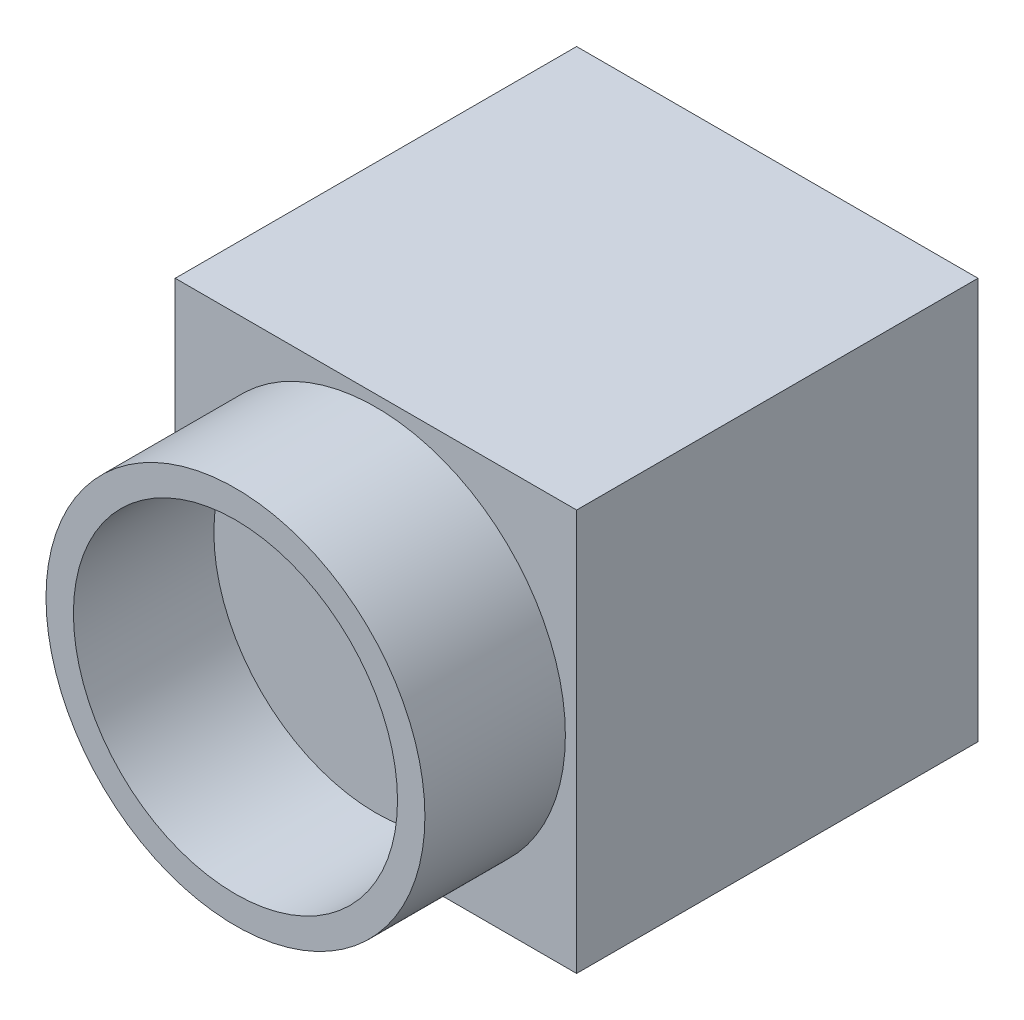
ISO-10303-21;
HEADER;
FILE_DESCRIPTION(('STEP AP214'),'2;1');
FILE_NAME('part.step','',(''),(''),'','','');
FILE_SCHEMA(('AUTOMOTIVE_DESIGN { 1 0 10303 214 1 1 1 1 }'));
ENDSEC;
DATA;
#1=APPLICATION_CONTEXT('core data for automotive mechanical design processes');
#2=APPLICATION_PROTOCOL_DEFINITION('international standard','automotive_design',2000,#1);
#3=PRODUCT_CONTEXT('',#1,'mechanical');
#4=PRODUCT('Part','Part','',(#3));
#5=PRODUCT_RELATED_PRODUCT_CATEGORY('part','',(#4));
#6=PRODUCT_DEFINITION_FORMATION('','',#4);
#7=PRODUCT_DEFINITION_CONTEXT('part definition',#1,'design');
#8=PRODUCT_DEFINITION('design','',#6,#7);
#9=PRODUCT_DEFINITION_SHAPE('','',#8);
#10=(LENGTH_UNIT() NAMED_UNIT(*) SI_UNIT(.MILLI.,.METRE.));
#11=(NAMED_UNIT(*) PLANE_ANGLE_UNIT() SI_UNIT($,.RADIAN.));
#12=(NAMED_UNIT(*) SI_UNIT($,.STERADIAN.) SOLID_ANGLE_UNIT());
#13=UNCERTAINTY_MEASURE_WITH_UNIT(LENGTH_MEASURE(1.E-05),#10,'distance_accuracy_value','');
#14=(GEOMETRIC_REPRESENTATION_CONTEXT(3) GLOBAL_UNCERTAINTY_ASSIGNED_CONTEXT((#13)) GLOBAL_UNIT_ASSIGNED_CONTEXT((#10,
#11,#12)) REPRESENTATION_CONTEXT('',''));
#15=CARTESIAN_POINT('',(0.,0.,0.));
#16=DIRECTION('',(0.,0.,1.));
#17=DIRECTION('',(1.,0.,0.));
#18=AXIS2_PLACEMENT_3D('',#15,#16,#17);
#19=CARTESIAN_POINT('',(14.645,14.645,-14.645));
#20=DIRECTION('',(-1.,0.,0.));
#21=DIRECTION('',(0.,0.,1.));
#22=AXIS2_PLACEMENT_3D('',#19,#20,#21);
#23=PLANE('',#22);
#24=DIRECTION('',(0.,0.,-1.));
#25=VECTOR('',#24,1.);
#26=CARTESIAN_POINT('',(14.645,-14.645,-14.645));
#27=LINE('',#26,#25);
#28=CARTESIAN_POINT('',(14.645,-14.645,14.645));
#29=VERTEX_POINT('',#28);
#30=CARTESIAN_POINT('',(14.645,-14.645,-14.645));
#31=VERTEX_POINT('',#30);
#32=EDGE_CURVE('E109',#29,#31,#27,.T.);
#33=ORIENTED_EDGE('',*,*,#32,.T.);
#34=DIRECTION('',(0.,-1.,0.));
#35=VECTOR('',#34,1.);
#36=CARTESIAN_POINT('',(14.645,14.645,-14.645));
#37=LINE('',#36,#35);
#38=CARTESIAN_POINT('',(14.645,14.645,-14.645));
#39=VERTEX_POINT('',#38);
#40=EDGE_CURVE('E46',#39,#31,#37,.T.);
#41=ORIENTED_EDGE('',*,*,#40,.F.);
#42=DIRECTION('',(0.,0.,-1.));
#43=VECTOR('',#42,1.);
#44=CARTESIAN_POINT('',(14.645,14.645,-14.645));
#45=LINE('',#44,#43);
#46=CARTESIAN_POINT('',(14.645,14.645,14.645));
#47=VERTEX_POINT('',#46);
#48=EDGE_CURVE('E96',#47,#39,#45,.T.);
#49=ORIENTED_EDGE('',*,*,#48,.F.);
#50=DIRECTION('',(0.,-1.,0.));
#51=VECTOR('',#50,1.);
#52=CARTESIAN_POINT('',(14.645,14.645,14.645));
#53=LINE('',#52,#51);
#54=EDGE_CURVE('E105',#47,#29,#53,.T.);
#55=ORIENTED_EDGE('',*,*,#54,.T.);
#56=EDGE_LOOP('',(#33,#41,#49,#55));
#57=FACE_BOUND('',#56,.T.);
#58=ADVANCED_FACE('F43',(#57),#23,.F.);
#59=CARTESIAN_POINT('',(-14.645,14.645,-14.645));
#60=DIRECTION('',(0.,0.,1.));
#61=DIRECTION('',(1.,0.,0.));
#62=AXIS2_PLACEMENT_3D('',#59,#60,#61);
#63=PLANE('',#62);
#64=DIRECTION('',(-1.,0.,0.));
#65=VECTOR('',#64,1.);
#66=CARTESIAN_POINT('',(-14.645,-14.645,-14.645));
#67=LINE('',#66,#65);
#68=CARTESIAN_POINT('',(-14.645,-14.645,-14.645));
#69=VERTEX_POINT('',#68);
#70=EDGE_CURVE('E101',#31,#69,#67,.T.);
#71=ORIENTED_EDGE('',*,*,#70,.T.);
#72=DIRECTION('',(0.,-1.,0.));
#73=VECTOR('',#72,1.);
#74=CARTESIAN_POINT('',(-14.645,14.645,-14.645));
#75=LINE('',#74,#73);
#76=CARTESIAN_POINT('',(-14.645,14.645,-14.645));
#77=VERTEX_POINT('',#76);
#78=EDGE_CURVE('E99',#77,#69,#75,.T.);
#79=ORIENTED_EDGE('',*,*,#78,.F.);
#80=DIRECTION('',(-1.,0.,0.));
#81=VECTOR('',#80,1.);
#82=CARTESIAN_POINT('',(-14.645,14.645,-14.645));
#83=LINE('',#82,#81);
#84=EDGE_CURVE('E91',#39,#77,#83,.T.);
#85=ORIENTED_EDGE('',*,*,#84,.F.);
#86=ORIENTED_EDGE('',*,*,#40,.T.);
#87=EDGE_LOOP('',(#71,#79,#85,#86));
#88=FACE_BOUND('',#87,.T.);
#89=ADVANCED_FACE('F100',(#88),#63,.F.);
#90=CARTESIAN_POINT('',(-14.645,14.645,-14.645));
#91=DIRECTION('',(1.,0.,0.));
#92=DIRECTION('',(0.,0.,-1.));
#93=AXIS2_PLACEMENT_3D('',#90,#91,#92);
#94=PLANE('',#93);
#95=DIRECTION('',(0.,0.,1.));
#96=VECTOR('',#95,1.);
#97=CARTESIAN_POINT('',(-14.645,-14.645,-14.645));
#98=LINE('',#97,#96);
#99=CARTESIAN_POINT('',(-14.645,-14.645,14.645));
#100=VERTEX_POINT('',#99);
#101=EDGE_CURVE('E77',#69,#100,#98,.T.);
#102=ORIENTED_EDGE('',*,*,#101,.T.);
#103=DIRECTION('',(0.,-1.,0.));
#104=VECTOR('',#103,1.);
#105=CARTESIAN_POINT('',(-14.645,14.645,14.645));
#106=LINE('',#105,#104);
#107=CARTESIAN_POINT('',(-14.645,14.645,14.645));
#108=VERTEX_POINT('',#107);
#109=EDGE_CURVE('E102',#108,#100,#106,.T.);
#110=ORIENTED_EDGE('',*,*,#109,.F.);
#111=DIRECTION('',(0.,0.,1.));
#112=VECTOR('',#111,1.);
#113=CARTESIAN_POINT('',(-14.645,14.645,-14.645));
#114=LINE('',#113,#112);
#115=EDGE_CURVE('E94',#77,#108,#114,.T.);
#116=ORIENTED_EDGE('',*,*,#115,.F.);
#117=ORIENTED_EDGE('',*,*,#78,.T.);
#118=EDGE_LOOP('',(#102,#110,#116,#117));
#119=FACE_BOUND('',#118,.T.);
#120=ADVANCED_FACE('F103',(#119),#94,.F.);
#121=CARTESIAN_POINT('',(-14.645,14.645,14.645));
#122=DIRECTION('',(0.,0.,-1.));
#123=DIRECTION('',(-1.,0.,0.));
#124=AXIS2_PLACEMENT_3D('',#121,#122,#123);
#125=PLANE('',#124);
#126=CARTESIAN_POINT('',(0.,0.,14.645));
#127=DIRECTION('',(0.,0.,1.));
#128=DIRECTION('',(1.,0.,0.));
#129=AXIS2_PLACEMENT_3D('',#126,#127,#128);
#130=CIRCLE('',#129,13.825);
#131=CARTESIAN_POINT('',(13.825,0.,14.645));
#132=VERTEX_POINT('',#131);
#133=EDGE_CURVE('E11',#132,#132,#130,.T.);
#134=ORIENTED_EDGE('',*,*,#133,.F.);
#135=EDGE_LOOP('',(#134));
#136=FACE_BOUND('',#135,.T.);
#137=DIRECTION('',(1.,0.,0.));
#138=VECTOR('',#137,1.);
#139=CARTESIAN_POINT('',(-14.645,-14.645,14.645));
#140=LINE('',#139,#138);
#141=EDGE_CURVE('E83',#100,#29,#140,.T.);
#142=ORIENTED_EDGE('',*,*,#141,.T.);
#143=ORIENTED_EDGE('',*,*,#54,.F.);
#144=DIRECTION('',(1.,0.,0.));
#145=VECTOR('',#144,1.);
#146=CARTESIAN_POINT('',(-14.645,14.645,14.645));
#147=LINE('',#146,#145);
#148=EDGE_CURVE('E60',#108,#47,#147,.T.);
#149=ORIENTED_EDGE('',*,*,#148,.F.);
#150=ORIENTED_EDGE('',*,*,#109,.T.);
#151=EDGE_LOOP('',(#142,#143,#149,#150));
#152=FACE_BOUND('',#151,.T.);
#153=ADVANCED_FACE('F117',(#136,#152),#125,.F.);
#154=CARTESIAN_POINT('',(0.,14.645,0.));
#155=DIRECTION('',(0.,1.,0.));
#156=DIRECTION('',(0.,0.,1.));
#157=AXIS2_PLACEMENT_3D('',#154,#155,#156);
#158=PLANE('',#157);
#159=ORIENTED_EDGE('',*,*,#48,.T.);
#160=ORIENTED_EDGE('',*,*,#84,.T.);
#161=ORIENTED_EDGE('',*,*,#115,.T.);
#162=ORIENTED_EDGE('',*,*,#148,.T.);
#163=EDGE_LOOP('',(#159,#160,#161,#162));
#164=FACE_BOUND('',#163,.T.);
#165=ADVANCED_FACE('F92',(#164),#158,.T.);
#166=CARTESIAN_POINT('',(0.,-14.645,0.));
#167=DIRECTION('',(0.,1.,0.));
#168=DIRECTION('',(0.,0.,1.));
#169=AXIS2_PLACEMENT_3D('',#166,#167,#168);
#170=PLANE('',#169);
#171=ORIENTED_EDGE('',*,*,#32,.F.);
#172=ORIENTED_EDGE('',*,*,#141,.F.);
#173=ORIENTED_EDGE('',*,*,#101,.F.);
#174=ORIENTED_EDGE('',*,*,#70,.F.);
#175=EDGE_LOOP('',(#171,#172,#173,#174));
#176=FACE_BOUND('',#175,.T.);
#177=ADVANCED_FACE('F120',(#176),#170,.F.);
#178=CARTESIAN_POINT('',(0.,0.,24.895));
#179=DIRECTION('',(0.,0.,-1.));
#180=DIRECTION('',(-1.,0.,0.));
#181=AXIS2_PLACEMENT_3D('',#178,#179,#180);
#182=CYLINDRICAL_SURFACE('',#181,13.825);
#183=CARTESIAN_POINT('',(0.,0.,24.895));
#184=DIRECTION('',(0.,0.,1.));
#185=DIRECTION('',(1.,0.,0.));
#186=AXIS2_PLACEMENT_3D('',#183,#184,#185);
#187=CIRCLE('',#186,13.825);
#188=CARTESIAN_POINT('',(13.825,0.,24.895));
#189=VERTEX_POINT('',#188);
#190=EDGE_CURVE('E112',#189,#189,#187,.T.);
#191=ORIENTED_EDGE('',*,*,#190,.F.);
#192=EDGE_LOOP('',(#191));
#193=FACE_BOUND('',#192,.T.);
#194=ORIENTED_EDGE('',*,*,#133,.T.);
#195=EDGE_LOOP('',(#194));
#196=FACE_BOUND('',#195,.T.);
#197=ADVANCED_FACE('F139',(#193,#196),#182,.T.);
#198=CARTESIAN_POINT('',(0.,0.,24.895));
#199=DIRECTION('',(0.,0.,1.));
#200=DIRECTION('',(1.,0.,0.));
#201=AXIS2_PLACEMENT_3D('',#198,#199,#200);
#202=PLANE('',#201);
#203=CARTESIAN_POINT('',(0.,0.,24.895));
#204=DIRECTION('',(0.,0.,1.));
#205=DIRECTION('',(1.,0.,0.));
#206=AXIS2_PLACEMENT_3D('',#203,#204,#205);
#207=CIRCLE('',#206,11.825);
#208=CARTESIAN_POINT('',(11.825,0.,24.895));
#209=VERTEX_POINT('',#208);
#210=EDGE_CURVE('E128',#209,#209,#207,.T.);
#211=ORIENTED_EDGE('',*,*,#210,.F.);
#212=EDGE_LOOP('',(#211));
#213=FACE_BOUND('',#212,.T.);
#214=ORIENTED_EDGE('',*,*,#190,.T.);
#215=EDGE_LOOP('',(#214));
#216=FACE_BOUND('',#215,.T.);
#217=ADVANCED_FACE('F135',(#213,#216),#202,.T.);
#218=CARTESIAN_POINT('',(-14.645,14.645,14.645));
#219=DIRECTION('',(0.,0.,-1.));
#220=DIRECTION('',(-1.,0.,0.));
#221=AXIS2_PLACEMENT_3D('',#218,#219,#220);
#222=PLANE('',#221);
#223=CARTESIAN_POINT('',(0.,0.,14.645));
#224=DIRECTION('',(0.,0.,-1.));
#225=DIRECTION('',(-1.,0.,0.));
#226=AXIS2_PLACEMENT_3D('',#223,#224,#225);
#227=CIRCLE('',#226,11.825);
#228=CARTESIAN_POINT('',(-11.825,0.,14.645));
#229=VERTEX_POINT('',#228);
#230=EDGE_CURVE('E125',#229,#229,#227,.F.);
#231=ORIENTED_EDGE('',*,*,#230,.T.);
#232=EDGE_LOOP('',(#231));
#233=FACE_BOUND('',#232,.T.);
#234=ADVANCED_FACE('F138',(#233),#222,.F.);
#235=CARTESIAN_POINT('',(0.,0.,-18.8011507501237));
#236=DIRECTION('',(0.,0.,1.));
#237=DIRECTION('',(1.,0.,0.));
#238=AXIS2_PLACEMENT_3D('',#235,#236,#237);
#239=CYLINDRICAL_SURFACE('',#238,11.825);
#240=ORIENTED_EDGE('',*,*,#210,.T.);
#241=EDGE_LOOP('',(#240));
#242=FACE_BOUND('',#241,.T.);
#243=ORIENTED_EDGE('',*,*,#230,.F.);
#244=EDGE_LOOP('',(#243));
#245=FACE_BOUND('',#244,.T.);
#246=ADVANCED_FACE('F132',(#242,#245),#239,.F.);
#247=CLOSED_SHELL('',(#58,#89,#120,#153,#165,#177,#197,#217,#234,#246));
#248=MANIFOLD_SOLID_BREP('B2',#247);
#249=ADVANCED_BREP_SHAPE_REPRESENTATION('',(#18,#248),#14);
#250=SHAPE_DEFINITION_REPRESENTATION(#9,#249);
ENDSEC;
END-ISO-10303-21;
